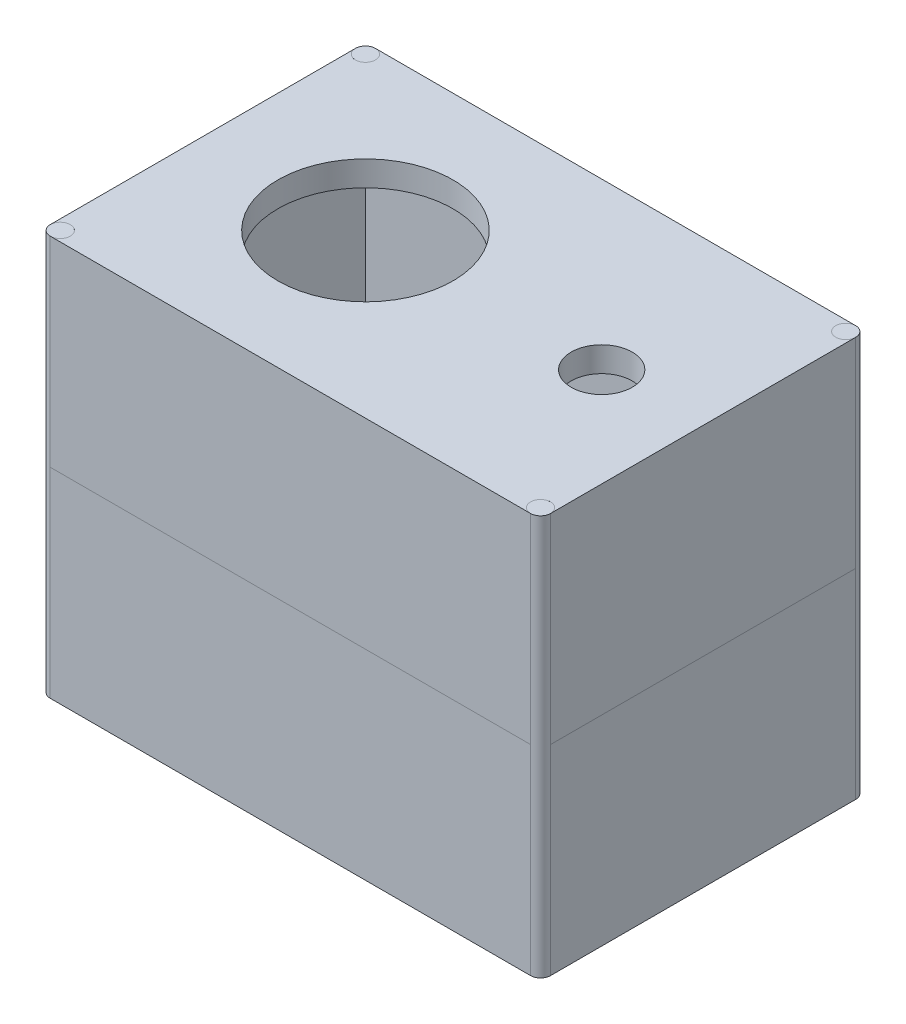
ISO-10303-21;
HEADER;
FILE_DESCRIPTION(('STEP AP214'),'2;1');
FILE_NAME('part.step','',(''),(''),'','','');
FILE_SCHEMA(('AUTOMOTIVE_DESIGN { 1 0 10303 214 1 1 1 1 }'));
ENDSEC;
DATA;
#1=APPLICATION_CONTEXT('core data for automotive mechanical design processes');
#2=APPLICATION_PROTOCOL_DEFINITION('international standard','automotive_design',2000,#1);
#3=PRODUCT_CONTEXT('',#1,'mechanical');
#4=PRODUCT('Part','Part','',(#3));
#5=PRODUCT_RELATED_PRODUCT_CATEGORY('part','',(#4));
#6=PRODUCT_DEFINITION_FORMATION('','',#4);
#7=PRODUCT_DEFINITION_CONTEXT('part definition',#1,'design');
#8=PRODUCT_DEFINITION('design','',#6,#7);
#9=PRODUCT_DEFINITION_SHAPE('','',#8);
#10=(LENGTH_UNIT() NAMED_UNIT(*) SI_UNIT(.MILLI.,.METRE.));
#11=(NAMED_UNIT(*) PLANE_ANGLE_UNIT() SI_UNIT($,.RADIAN.));
#12=(NAMED_UNIT(*) SI_UNIT($,.STERADIAN.) SOLID_ANGLE_UNIT());
#13=UNCERTAINTY_MEASURE_WITH_UNIT(LENGTH_MEASURE(1.E-05),#10,'distance_accuracy_value','');
#14=(GEOMETRIC_REPRESENTATION_CONTEXT(3) GLOBAL_UNCERTAINTY_ASSIGNED_CONTEXT((#13)) GLOBAL_UNIT_ASSIGNED_CONTEXT((#10,
#11,#12)) REPRESENTATION_CONTEXT('',''));
#15=CARTESIAN_POINT('',(0.,0.,0.));
#16=DIRECTION('',(0.,0.,1.));
#17=DIRECTION('',(1.,0.,0.));
#18=AXIS2_PLACEMENT_3D('',#15,#16,#17);
#19=CARTESIAN_POINT('',(0.,40.,0.));
#20=DIRECTION('',(0.,1.,0.));
#21=DIRECTION('',(0.,0.,1.));
#22=AXIS2_PLACEMENT_3D('',#19,#20,#21);
#23=PLANE('',#22);
#24=DIRECTION('',(0.,0.,1.));
#25=VECTOR('',#24,1.);
#26=CARTESIAN_POINT('',(50.9322033898305,40.,-28.0007704160247));
#27=LINE('',#26,#25);
#28=CARTESIAN_POINT('',(50.9322033898305,40.,-28.0007704160247));
#29=VERTEX_POINT('',#28);
#30=CARTESIAN_POINT('',(50.9322033898305,40.,26.9992295839753));
#31=VERTEX_POINT('',#30);
#32=EDGE_CURVE('E196',#29,#31,#27,.T.);
#33=ORIENTED_EDGE('',*,*,#32,.T.);
#34=DIRECTION('',(-1.,0.,0.));
#35=VECTOR('',#34,1.);
#36=CARTESIAN_POINT('',(-39.0677966101695,40.,26.9992295839753));
#37=LINE('',#36,#35);
#38=CARTESIAN_POINT('',(-39.0677966101695,40.,26.9992295839753));
#39=VERTEX_POINT('',#38);
#40=EDGE_CURVE('E193',#31,#39,#37,.T.);
#41=ORIENTED_EDGE('',*,*,#40,.T.);
#42=DIRECTION('',(0.,0.,-1.));
#43=VECTOR('',#42,1.);
#44=CARTESIAN_POINT('',(-39.0677966101695,40.,-28.0007704160247));
#45=LINE('',#44,#43);
#46=CARTESIAN_POINT('',(-39.0677966101695,40.,-28.0007704160247));
#47=VERTEX_POINT('',#46);
#48=EDGE_CURVE('E202',#39,#47,#45,.T.);
#49=ORIENTED_EDGE('',*,*,#48,.T.);
#50=DIRECTION('',(1.,0.,0.));
#51=VECTOR('',#50,1.);
#52=CARTESIAN_POINT('',(-39.0677966101695,40.,-28.0007704160247));
#53=LINE('',#52,#51);
#54=EDGE_CURVE('E199',#47,#29,#53,.T.);
#55=ORIENTED_EDGE('',*,*,#54,.T.);
#56=EDGE_LOOP('',(#33,#41,#49,#55));
#57=FACE_BOUND('',#56,.T.);
#58=DIRECTION('',(1.,0.,0.));
#59=VECTOR('',#58,1.);
#60=CARTESIAN_POINT('',(-44.0677966101695,40.,31.9992295839753));
#61=LINE('',#60,#59);
#62=CARTESIAN_POINT('',(-42.0677966101695,40.,31.9992295839753));
#63=VERTEX_POINT('',#62);
#64=CARTESIAN_POINT('',(53.9322033898305,40.,31.9992295839753));
#65=VERTEX_POINT('',#64);
#66=EDGE_CURVE('E205',#63,#65,#61,.T.);
#67=ORIENTED_EDGE('',*,*,#66,.T.);
#68=CARTESIAN_POINT('',(53.9322033898305,40.,29.9992295839753));
#69=DIRECTION('',(0.,1.,0.));
#70=DIRECTION('',(0.,0.,1.));
#71=AXIS2_PLACEMENT_3D('',#68,#69,#70);
#72=CIRCLE('',#71,2.);
#73=CARTESIAN_POINT('',(55.9322033898305,40.,29.9992295839753));
#74=VERTEX_POINT('',#73);
#75=EDGE_CURVE('E187',#65,#74,#72,.F.);
#76=ORIENTED_EDGE('',*,*,#75,.T.);
#77=DIRECTION('',(0.,0.,1.));
#78=VECTOR('',#77,1.);
#79=CARTESIAN_POINT('',(55.9322033898305,40.,29.9992295839753));
#80=LINE('',#79,#78);
#81=CARTESIAN_POINT('',(55.9322033898305,40.,-31.0007704160247));
#82=VERTEX_POINT('',#81);
#83=EDGE_CURVE('E179',#82,#74,#80,.T.);
#84=ORIENTED_EDGE('',*,*,#83,.F.);
#85=CARTESIAN_POINT('',(53.9322033898305,40.,-31.0007704160247));
#86=DIRECTION('',(0.,1.,0.));
#87=DIRECTION('',(0.,0.,1.));
#88=AXIS2_PLACEMENT_3D('',#85,#86,#87);
#89=CIRCLE('',#88,2.);
#90=CARTESIAN_POINT('',(53.9322033898305,40.,-33.0007704160247));
#91=VERTEX_POINT('',#90);
#92=EDGE_CURVE('E190',#82,#91,#89,.F.);
#93=ORIENTED_EDGE('',*,*,#92,.T.);
#94=DIRECTION('',(-1.,0.,0.));
#95=VECTOR('',#94,1.);
#96=CARTESIAN_POINT('',(-44.0677966101695,40.,-33.0007704160247));
#97=LINE('',#96,#95);
#98=CARTESIAN_POINT('',(-42.0677966101695,40.,-33.0007704160247));
#99=VERTEX_POINT('',#98);
#100=EDGE_CURVE('E208',#91,#99,#97,.T.);
#101=ORIENTED_EDGE('',*,*,#100,.T.);
#102=CARTESIAN_POINT('',(-42.0677966101695,40.,-31.0007704160247));
#103=DIRECTION('',(0.,1.,0.));
#104=DIRECTION('',(0.,0.,1.));
#105=AXIS2_PLACEMENT_3D('',#102,#103,#104);
#106=CIRCLE('',#105,2.);
#107=CARTESIAN_POINT('',(-44.0677966101695,40.,-31.0007704160247));
#108=VERTEX_POINT('',#107);
#109=EDGE_CURVE('E138',#99,#108,#106,.F.);
#110=ORIENTED_EDGE('',*,*,#109,.T.);
#111=DIRECTION('',(0.,0.,1.));
#112=VECTOR('',#111,1.);
#113=CARTESIAN_POINT('',(-44.0677966101695,40.,-33.0007704160247));
#114=LINE('',#113,#112);
#115=CARTESIAN_POINT('',(-44.0677966101695,40.,29.9992295839753));
#116=VERTEX_POINT('',#115);
#117=EDGE_CURVE('E210',#108,#116,#114,.T.);
#118=ORIENTED_EDGE('',*,*,#117,.T.);
#119=CARTESIAN_POINT('',(-42.0677966101695,40.,29.9992295839753));
#120=DIRECTION('',(0.,1.,0.));
#121=DIRECTION('',(0.,0.,1.));
#122=AXIS2_PLACEMENT_3D('',#119,#120,#121);
#123=CIRCLE('',#122,2.);
#124=EDGE_CURVE('E184',#116,#63,#123,.F.);
#125=ORIENTED_EDGE('',*,*,#124,.T.);
#126=EDGE_LOOP('',(#67,#76,#84,#93,#101,#110,#118,#125));
#127=FACE_BOUND('',#126,.T.);
#128=ADVANCED_FACE('F48',(#57,#127),#23,.T.);
#129=CARTESIAN_POINT('',(-44.0677966101695,80.,31.9992295839753));
#130=DIRECTION('',(0.,0.,-1.));
#131=DIRECTION('',(-1.,0.,0.));
#132=AXIS2_PLACEMENT_3D('',#129,#130,#131);
#133=PLANE('',#132);
#134=ORIENTED_EDGE('',*,*,#66,.F.);
#135=DIRECTION('',(0.,1.,0.));
#136=VECTOR('',#135,1.);
#137=CARTESIAN_POINT('',(-42.0677966101695,-0.00999999999999612,31.9992295839753));
#138=LINE('',#137,#136);
#139=CARTESIAN_POINT('',(-42.0677966101695,0.,31.9992295839753));
#140=VERTEX_POINT('',#139);
#141=EDGE_CURVE('E229',#140,#63,#138,.T.);
#142=ORIENTED_EDGE('',*,*,#141,.F.);
#143=DIRECTION('',(1.,0.,0.));
#144=VECTOR('',#143,1.);
#145=CARTESIAN_POINT('',(-44.0677966101695,0.,31.9992295839753));
#146=LINE('',#145,#144);
#147=CARTESIAN_POINT('',(53.9322033898305,0.,31.9992295839753));
#148=VERTEX_POINT('',#147);
#149=EDGE_CURVE('E162',#140,#148,#146,.T.);
#150=ORIENTED_EDGE('',*,*,#149,.T.);
#151=DIRECTION('',(0.,1.,0.));
#152=VECTOR('',#151,1.);
#153=CARTESIAN_POINT('',(53.9322033898305,-0.00999999999999612,31.9992295839753));
#154=LINE('',#153,#152);
#155=EDGE_CURVE('E221',#148,#65,#154,.T.);
#156=ORIENTED_EDGE('',*,*,#155,.T.);
#157=EDGE_LOOP('',(#134,#142,#150,#156));
#158=FACE_BOUND('',#157,.T.);
#159=ADVANCED_FACE('F243',(#158),#133,.F.);
#160=CARTESIAN_POINT('',(-44.0677966101695,80.,-33.0007704160247));
#161=DIRECTION('',(0.,0.,1.));
#162=DIRECTION('',(1.,0.,0.));
#163=AXIS2_PLACEMENT_3D('',#160,#161,#162);
#164=PLANE('',#163);
#165=ORIENTED_EDGE('',*,*,#100,.F.);
#166=DIRECTION('',(0.,1.,0.));
#167=VECTOR('',#166,1.);
#168=CARTESIAN_POINT('',(53.9322033898305,-0.00999999999999612,-33.0007704160247));
#169=LINE('',#168,#167);
#170=CARTESIAN_POINT('',(53.9322033898305,0.,-33.0007704160247));
#171=VERTEX_POINT('',#170);
#172=EDGE_CURVE('E12',#171,#91,#169,.T.);
#173=ORIENTED_EDGE('',*,*,#172,.F.);
#174=DIRECTION('',(-1.,0.,0.));
#175=VECTOR('',#174,1.);
#176=CARTESIAN_POINT('',(-44.0677966101695,0.,-33.0007704160247));
#177=LINE('',#176,#175);
#178=CARTESIAN_POINT('',(-42.0677966101695,0.,-33.0007704160247));
#179=VERTEX_POINT('',#178);
#180=EDGE_CURVE('E144',#171,#179,#177,.T.);
#181=ORIENTED_EDGE('',*,*,#180,.T.);
#182=DIRECTION('',(0.,1.,0.));
#183=VECTOR('',#182,1.);
#184=CARTESIAN_POINT('',(-42.0677966101695,-0.00999999999999612,-33.0007704160247));
#185=LINE('',#184,#183);
#186=EDGE_CURVE('E132',#179,#99,#185,.T.);
#187=ORIENTED_EDGE('',*,*,#186,.T.);
#188=EDGE_LOOP('',(#165,#173,#181,#187));
#189=FACE_BOUND('',#188,.T.);
#190=ADVANCED_FACE('F158',(#189),#164,.F.);
#191=CARTESIAN_POINT('',(-44.0677966101695,80.,-33.0007704160247));
#192=DIRECTION('',(1.,0.,0.));
#193=DIRECTION('',(0.,0.,-1.));
#194=AXIS2_PLACEMENT_3D('',#191,#192,#193);
#195=PLANE('',#194);
#196=ORIENTED_EDGE('',*,*,#117,.F.);
#197=DIRECTION('',(0.,1.,0.));
#198=VECTOR('',#197,1.);
#199=CARTESIAN_POINT('',(-44.0677966101695,-0.00999999999999612,-31.0007704160247));
#200=LINE('',#199,#198);
#201=CARTESIAN_POINT('',(-44.0677966101695,0.,-31.0007704160247));
#202=VERTEX_POINT('',#201);
#203=EDGE_CURVE('E227',#202,#108,#200,.T.);
#204=ORIENTED_EDGE('',*,*,#203,.F.);
#205=DIRECTION('',(0.,0.,1.));
#206=VECTOR('',#205,1.);
#207=CARTESIAN_POINT('',(-44.0677966101695,0.,-33.0007704160247));
#208=LINE('',#207,#206);
#209=CARTESIAN_POINT('',(-44.0677966101695,0.,29.9992295839753));
#210=VERTEX_POINT('',#209);
#211=EDGE_CURVE('E153',#202,#210,#208,.T.);
#212=ORIENTED_EDGE('',*,*,#211,.T.);
#213=DIRECTION('',(0.,1.,0.));
#214=VECTOR('',#213,1.);
#215=CARTESIAN_POINT('',(-44.0677966101695,-0.00999999999999612,29.9992295839753));
#216=LINE('',#215,#214);
#217=EDGE_CURVE('E224',#210,#116,#216,.T.);
#218=ORIENTED_EDGE('',*,*,#217,.T.);
#219=EDGE_LOOP('',(#196,#204,#212,#218));
#220=FACE_BOUND('',#219,.T.);
#221=ADVANCED_FACE('F50',(#220),#195,.F.);
#222=CARTESIAN_POINT('',(0.,0.,0.));
#223=DIRECTION('',(0.,1.,0.));
#224=DIRECTION('',(0.,0.,1.));
#225=AXIS2_PLACEMENT_3D('',#222,#223,#224);
#226=PLANE('',#225);
#227=ORIENTED_EDGE('',*,*,#211,.F.);
#228=CARTESIAN_POINT('',(-42.0677966101695,0.,-31.0007704160247));
#229=DIRECTION('',(0.,1.,0.));
#230=DIRECTION('',(0.,0.,1.));
#231=AXIS2_PLACEMENT_3D('',#228,#229,#230);
#232=CIRCLE('',#231,2.);
#233=EDGE_CURVE('E135',#179,#202,#232,.T.);
#234=ORIENTED_EDGE('',*,*,#233,.F.);
#235=ORIENTED_EDGE('',*,*,#180,.F.);
#236=CARTESIAN_POINT('',(53.9322033898305,0.,-31.0007704160247));
#237=DIRECTION('',(0.,1.,0.));
#238=DIRECTION('',(0.,0.,1.));
#239=AXIS2_PLACEMENT_3D('',#236,#237,#238);
#240=CIRCLE('',#239,2.);
#241=CARTESIAN_POINT('',(55.9322033898305,0.,-31.0007704160247));
#242=VERTEX_POINT('',#241);
#243=EDGE_CURVE('E166',#242,#171,#240,.T.);
#244=ORIENTED_EDGE('',*,*,#243,.F.);
#245=DIRECTION('',(0.,0.,-1.));
#246=VECTOR('',#245,1.);
#247=CARTESIAN_POINT('',(55.9322033898305,0.,-33.0007704160247));
#248=LINE('',#247,#246);
#249=CARTESIAN_POINT('',(55.9322033898305,0.,29.9992295839753));
#250=VERTEX_POINT('',#249);
#251=EDGE_CURVE('E159',#250,#242,#248,.T.);
#252=ORIENTED_EDGE('',*,*,#251,.F.);
#253=CARTESIAN_POINT('',(53.9322033898305,0.,29.9992295839753));
#254=DIRECTION('',(0.,1.,0.));
#255=DIRECTION('',(0.,0.,1.));
#256=AXIS2_PLACEMENT_3D('',#253,#254,#255);
#257=CIRCLE('',#256,2.);
#258=EDGE_CURVE('E234',#148,#250,#257,.T.);
#259=ORIENTED_EDGE('',*,*,#258,.F.);
#260=ORIENTED_EDGE('',*,*,#149,.F.);
#261=CARTESIAN_POINT('',(-42.0677966101695,0.,29.9992295839753));
#262=DIRECTION('',(0.,1.,0.));
#263=DIRECTION('',(0.,0.,1.));
#264=AXIS2_PLACEMENT_3D('',#261,#262,#263);
#265=CIRCLE('',#264,2.);
#266=EDGE_CURVE('E154',#210,#140,#265,.T.);
#267=ORIENTED_EDGE('',*,*,#266,.F.);
#268=EDGE_LOOP('',(#227,#234,#235,#244,#252,#259,#260,#267));
#269=FACE_BOUND('',#268,.T.);
#270=ADVANCED_FACE('F149',(#269),#226,.F.);
#271=CARTESIAN_POINT('',(55.9322033898305,80.,-33.0007704160247));
#272=DIRECTION('',(-1.,0.,0.));
#273=DIRECTION('',(0.,0.,1.));
#274=AXIS2_PLACEMENT_3D('',#271,#272,#273);
#275=PLANE('',#274);
#276=DIRECTION('',(0.,1.,0.));
#277=VECTOR('',#276,1.);
#278=CARTESIAN_POINT('',(55.9322033898305,-0.00999999999999612,-31.0007704160247));
#279=LINE('',#278,#277);
#280=EDGE_CURVE('E143',#242,#82,#279,.T.);
#281=ORIENTED_EDGE('',*,*,#280,.T.);
#282=ORIENTED_EDGE('',*,*,#83,.T.);
#283=DIRECTION('',(0.,1.,0.));
#284=VECTOR('',#283,1.);
#285=CARTESIAN_POINT('',(55.9322033898305,-0.00999999999999612,29.9992295839753));
#286=LINE('',#285,#284);
#287=EDGE_CURVE('E57',#250,#74,#286,.T.);
#288=ORIENTED_EDGE('',*,*,#287,.F.);
#289=ORIENTED_EDGE('',*,*,#251,.T.);
#290=EDGE_LOOP('',(#281,#282,#288,#289));
#291=FACE_BOUND('',#290,.T.);
#292=ADVANCED_FACE('F238',(#291),#275,.F.);
#293=CARTESIAN_POINT('',(-39.0677966101695,-175.475115548645,26.9992295839753));
#294=DIRECTION('',(0.,0.,1.));
#295=DIRECTION('',(1.,0.,0.));
#296=AXIS2_PLACEMENT_3D('',#293,#294,#295);
#297=PLANE('',#296);
#298=ORIENTED_EDGE('',*,*,#40,.F.);
#299=DIRECTION('',(0.,1.,0.));
#300=VECTOR('',#299,1.);
#301=CARTESIAN_POINT('',(50.9322033898305,-175.475115548645,26.9992295839753));
#302=LINE('',#301,#300);
#303=CARTESIAN_POINT('',(50.9322033898305,5.,26.9992295839753));
#304=VERTEX_POINT('',#303);
#305=EDGE_CURVE('E214',#304,#31,#302,.T.);
#306=ORIENTED_EDGE('',*,*,#305,.F.);
#307=DIRECTION('',(-1.,0.,0.));
#308=VECTOR('',#307,1.);
#309=CARTESIAN_POINT('',(-39.0677966101695,5.,26.9992295839753));
#310=LINE('',#309,#308);
#311=CARTESIAN_POINT('',(-39.0677966101695,5.,26.9992295839753));
#312=VERTEX_POINT('',#311);
#313=EDGE_CURVE('E169',#304,#312,#310,.T.);
#314=ORIENTED_EDGE('',*,*,#313,.T.);
#315=DIRECTION('',(0.,1.,0.));
#316=VECTOR('',#315,1.);
#317=CARTESIAN_POINT('',(-39.0677966101695,-175.475115548645,26.9992295839753));
#318=LINE('',#317,#316);
#319=EDGE_CURVE('E182',#312,#39,#318,.T.);
#320=ORIENTED_EDGE('',*,*,#319,.T.);
#321=EDGE_LOOP('',(#298,#306,#314,#320));
#322=FACE_BOUND('',#321,.T.);
#323=ADVANCED_FACE('F272',(#322),#297,.F.);
#324=CARTESIAN_POINT('',(50.9322033898305,-175.475115548645,-28.0007704160247));
#325=DIRECTION('',(1.,0.,0.));
#326=DIRECTION('',(0.,0.,-1.));
#327=AXIS2_PLACEMENT_3D('',#324,#325,#326);
#328=PLANE('',#327);
#329=ORIENTED_EDGE('',*,*,#32,.F.);
#330=DIRECTION('',(0.,1.,0.));
#331=VECTOR('',#330,1.);
#332=CARTESIAN_POINT('',(50.9322033898305,-175.475115548645,-28.0007704160247));
#333=LINE('',#332,#331);
#334=CARTESIAN_POINT('',(50.9322033898305,5.,-28.0007704160247));
#335=VERTEX_POINT('',#334);
#336=EDGE_CURVE('E216',#335,#29,#333,.T.);
#337=ORIENTED_EDGE('',*,*,#336,.F.);
#338=DIRECTION('',(0.,0.,1.));
#339=VECTOR('',#338,1.);
#340=CARTESIAN_POINT('',(50.9322033898305,5.,-28.0007704160247));
#341=LINE('',#340,#339);
#342=EDGE_CURVE('E172',#335,#304,#341,.T.);
#343=ORIENTED_EDGE('',*,*,#342,.T.);
#344=ORIENTED_EDGE('',*,*,#305,.T.);
#345=EDGE_LOOP('',(#329,#337,#343,#344));
#346=FACE_BOUND('',#345,.T.);
#347=ADVANCED_FACE('F278',(#346),#328,.F.);
#348=CARTESIAN_POINT('',(-39.0677966101695,-175.475115548645,-28.0007704160247));
#349=DIRECTION('',(0.,0.,-1.));
#350=DIRECTION('',(-1.,0.,0.));
#351=AXIS2_PLACEMENT_3D('',#348,#349,#350);
#352=PLANE('',#351);
#353=ORIENTED_EDGE('',*,*,#54,.F.);
#354=DIRECTION('',(0.,1.,0.));
#355=VECTOR('',#354,1.);
#356=CARTESIAN_POINT('',(-39.0677966101695,-175.475115548645,-28.0007704160247));
#357=LINE('',#356,#355);
#358=CARTESIAN_POINT('',(-39.0677966101695,5.,-28.0007704160247));
#359=VERTEX_POINT('',#358);
#360=EDGE_CURVE('E174',#359,#47,#357,.T.);
#361=ORIENTED_EDGE('',*,*,#360,.F.);
#362=DIRECTION('',(1.,0.,0.));
#363=VECTOR('',#362,1.);
#364=CARTESIAN_POINT('',(-39.0677966101695,5.,-28.0007704160247));
#365=LINE('',#364,#363);
#366=EDGE_CURVE('E63',#359,#335,#365,.T.);
#367=ORIENTED_EDGE('',*,*,#366,.T.);
#368=ORIENTED_EDGE('',*,*,#336,.T.);
#369=EDGE_LOOP('',(#353,#361,#367,#368));
#370=FACE_BOUND('',#369,.T.);
#371=ADVANCED_FACE('F295',(#370),#352,.F.);
#372=CARTESIAN_POINT('',(-39.0677966101695,-175.475115548645,-28.0007704160247));
#373=DIRECTION('',(-1.,0.,0.));
#374=DIRECTION('',(0.,0.,1.));
#375=AXIS2_PLACEMENT_3D('',#372,#373,#374);
#376=PLANE('',#375);
#377=ORIENTED_EDGE('',*,*,#48,.F.);
#378=ORIENTED_EDGE('',*,*,#319,.F.);
#379=DIRECTION('',(0.,0.,-1.));
#380=VECTOR('',#379,1.);
#381=CARTESIAN_POINT('',(-39.0677966101695,5.,-28.0007704160247));
#382=LINE('',#381,#380);
#383=EDGE_CURVE('E176',#312,#359,#382,.T.);
#384=ORIENTED_EDGE('',*,*,#383,.T.);
#385=ORIENTED_EDGE('',*,*,#360,.T.);
#386=EDGE_LOOP('',(#377,#378,#384,#385));
#387=FACE_BOUND('',#386,.T.);
#388=ADVANCED_FACE('F293',(#387),#376,.F.);
#389=CARTESIAN_POINT('',(0.,5.,0.));
#390=DIRECTION('',(0.,1.,0.));
#391=DIRECTION('',(0.,0.,1.));
#392=AXIS2_PLACEMENT_3D('',#389,#390,#391);
#393=PLANE('',#392);
#394=ORIENTED_EDGE('',*,*,#383,.F.);
#395=ORIENTED_EDGE('',*,*,#313,.F.);
#396=ORIENTED_EDGE('',*,*,#342,.F.);
#397=ORIENTED_EDGE('',*,*,#366,.F.);
#398=EDGE_LOOP('',(#394,#395,#396,#397));
#399=FACE_BOUND('',#398,.T.);
#400=ADVANCED_FACE('F291',(#399),#393,.T.);
#401=CARTESIAN_POINT('',(53.9322033898305,-0.00999999999999612,-31.0007704160247));
#402=DIRECTION('',(0.,1.,0.));
#403=DIRECTION('',(0.,0.,1.));
#404=AXIS2_PLACEMENT_3D('',#401,#402,#403);
#405=CYLINDRICAL_SURFACE('',#404,2.);
#406=CARTESIAN_POINT('',(53.9322033898305,80.,-31.0007704160247));
#407=DIRECTION('',(0.,1.,0.));
#408=DIRECTION('',(0.,0.,1.));
#409=AXIS2_PLACEMENT_3D('',#406,#407,#408);
#410=CIRCLE('',#409,2.);
#411=CARTESIAN_POINT('',(53.9322033898305,80.,-29.0007704160246));
#412=VERTEX_POINT('',#411);
#413=EDGE_CURVE('E245',#412,#412,#410,.T.);
#414=ORIENTED_EDGE('',*,*,#413,.F.);
#415=EDGE_LOOP('',(#414));
#416=FACE_BOUND('',#415,.T.);
#417=ORIENTED_EDGE('',*,*,#280,.F.);
#418=ORIENTED_EDGE('',*,*,#243,.T.);
#419=ORIENTED_EDGE('',*,*,#172,.T.);
#420=ORIENTED_EDGE('',*,*,#92,.F.);
#421=EDGE_LOOP('',(#417,#418,#419,#420));
#422=FACE_BOUND('',#421,.T.);
#423=ADVANCED_FACE('F290',(#416,#422),#405,.T.);
#424=CARTESIAN_POINT('',(0.,80.,0.));
#425=DIRECTION('',(0.,1.,0.));
#426=DIRECTION('',(0.,0.,1.));
#427=AXIS2_PLACEMENT_3D('',#424,#425,#426);
#428=PLANE('',#427);
#429=ORIENTED_EDGE('',*,*,#413,.T.);
#430=EDGE_LOOP('',(#429));
#431=FACE_BOUND('',#430,.T.);
#432=ADVANCED_FACE('F321',(#431),#428,.T.);
#433=CARTESIAN_POINT('',(53.9322033898305,-0.00999999999999612,29.9992295839753));
#434=DIRECTION('',(0.,1.,0.));
#435=DIRECTION('',(0.,0.,1.));
#436=AXIS2_PLACEMENT_3D('',#433,#434,#435);
#437=CYLINDRICAL_SURFACE('',#436,2.);
#438=CARTESIAN_POINT('',(53.9322033898305,80.,29.9992295839753));
#439=DIRECTION('',(0.,1.,0.));
#440=DIRECTION('',(0.,0.,1.));
#441=AXIS2_PLACEMENT_3D('',#438,#439,#440);
#442=CIRCLE('',#441,2.);
#443=CARTESIAN_POINT('',(53.9322033898305,80.,31.9992295839753));
#444=VERTEX_POINT('',#443);
#445=EDGE_CURVE('E246',#444,#444,#442,.T.);
#446=ORIENTED_EDGE('',*,*,#445,.F.);
#447=EDGE_LOOP('',(#446));
#448=FACE_BOUND('',#447,.T.);
#449=ORIENTED_EDGE('',*,*,#155,.F.);
#450=ORIENTED_EDGE('',*,*,#258,.T.);
#451=ORIENTED_EDGE('',*,*,#287,.T.);
#452=ORIENTED_EDGE('',*,*,#75,.F.);
#453=EDGE_LOOP('',(#449,#450,#451,#452));
#454=FACE_BOUND('',#453,.T.);
#455=ADVANCED_FACE('F232',(#448,#454),#437,.T.);
#456=CARTESIAN_POINT('',(0.,80.,0.));
#457=DIRECTION('',(0.,1.,0.));
#458=DIRECTION('',(0.,0.,1.));
#459=AXIS2_PLACEMENT_3D('',#456,#457,#458);
#460=PLANE('',#459);
#461=ORIENTED_EDGE('',*,*,#445,.T.);
#462=EDGE_LOOP('',(#461));
#463=FACE_BOUND('',#462,.T.);
#464=ADVANCED_FACE('F330',(#463),#460,.T.);
#465=CARTESIAN_POINT('',(-42.0677966101695,-0.00999999999999612,29.9992295839753));
#466=DIRECTION('',(0.,1.,0.));
#467=DIRECTION('',(0.,0.,1.));
#468=AXIS2_PLACEMENT_3D('',#465,#466,#467);
#469=CYLINDRICAL_SURFACE('',#468,2.);
#470=CARTESIAN_POINT('',(-42.0677966101695,80.,29.9992295839753));
#471=DIRECTION('',(0.,1.,0.));
#472=DIRECTION('',(0.,0.,1.));
#473=AXIS2_PLACEMENT_3D('',#470,#471,#472);
#474=CIRCLE('',#473,2.);
#475=CARTESIAN_POINT('',(-42.0677966101695,80.,31.9992295839753));
#476=VERTEX_POINT('',#475);
#477=EDGE_CURVE('E250',#476,#476,#474,.T.);
#478=ORIENTED_EDGE('',*,*,#477,.F.);
#479=EDGE_LOOP('',(#478));
#480=FACE_BOUND('',#479,.T.);
#481=ORIENTED_EDGE('',*,*,#217,.F.);
#482=ORIENTED_EDGE('',*,*,#266,.T.);
#483=ORIENTED_EDGE('',*,*,#141,.T.);
#484=ORIENTED_EDGE('',*,*,#124,.F.);
#485=EDGE_LOOP('',(#481,#482,#483,#484));
#486=FACE_BOUND('',#485,.T.);
#487=ADVANCED_FACE('F268',(#480,#486),#469,.T.);
#488=CARTESIAN_POINT('',(0.,80.,0.));
#489=DIRECTION('',(0.,1.,0.));
#490=DIRECTION('',(0.,0.,1.));
#491=AXIS2_PLACEMENT_3D('',#488,#489,#490);
#492=PLANE('',#491);
#493=ORIENTED_EDGE('',*,*,#477,.T.);
#494=EDGE_LOOP('',(#493));
#495=FACE_BOUND('',#494,.T.);
#496=ADVANCED_FACE('F262',(#495),#492,.T.);
#497=CARTESIAN_POINT('',(-42.0677966101695,-0.00999999999999612,-31.0007704160247));
#498=DIRECTION('',(0.,1.,0.));
#499=DIRECTION('',(0.,0.,1.));
#500=AXIS2_PLACEMENT_3D('',#497,#498,#499);
#501=CYLINDRICAL_SURFACE('',#500,2.);
#502=CARTESIAN_POINT('',(-42.0677966101695,80.,-31.0007704160247));
#503=DIRECTION('',(0.,1.,0.));
#504=DIRECTION('',(0.,0.,1.));
#505=AXIS2_PLACEMENT_3D('',#502,#503,#504);
#506=CIRCLE('',#505,2.);
#507=CARTESIAN_POINT('',(-42.0677966101695,80.,-29.0007704160246));
#508=VERTEX_POINT('',#507);
#509=EDGE_CURVE('E155',#508,#508,#506,.T.);
#510=ORIENTED_EDGE('',*,*,#509,.F.);
#511=EDGE_LOOP('',(#510));
#512=FACE_BOUND('',#511,.T.);
#513=ORIENTED_EDGE('',*,*,#186,.F.);
#514=ORIENTED_EDGE('',*,*,#233,.T.);
#515=ORIENTED_EDGE('',*,*,#203,.T.);
#516=ORIENTED_EDGE('',*,*,#109,.F.);
#517=EDGE_LOOP('',(#513,#514,#515,#516));
#518=FACE_BOUND('',#517,.T.);
#519=ADVANCED_FACE('F134',(#512,#518),#501,.T.);
#520=CARTESIAN_POINT('',(0.,80.,0.));
#521=DIRECTION('',(0.,1.,0.));
#522=DIRECTION('',(0.,0.,1.));
#523=AXIS2_PLACEMENT_3D('',#520,#521,#522);
#524=PLANE('',#523);
#525=ORIENTED_EDGE('',*,*,#509,.T.);
#526=EDGE_LOOP('',(#525));
#527=FACE_BOUND('',#526,.T.);
#528=ADVANCED_FACE('F259',(#527),#524,.T.);
#529=CLOSED_SHELL('',(#128,#159,#190,#221,#270,#292,#323,#347,#371,#388,#400,#423,#432,#455,
#464,#487,#496,#519,#528));
#530=MANIFOLD_SOLID_BREP('B2',#529);
#531=CARTESIAN_POINT('',(0.,40.,0.));
#532=DIRECTION('',(0.,1.,0.));
#533=DIRECTION('',(0.,0.,1.));
#534=AXIS2_PLACEMENT_3D('',#531,#532,#533);
#535=PLANE('',#534);
#536=DIRECTION('',(1.,0.,0.));
#537=VECTOR('',#536,1.);
#538=CARTESIAN_POINT('',(-44.0677966101695,40.,31.9992295839753));
#539=LINE('',#538,#537);
#540=CARTESIAN_POINT('',(-42.0677966101695,40.,31.9992295839753));
#541=VERTEX_POINT('',#540);
#542=CARTESIAN_POINT('',(53.9322033898305,40.,31.9992295839753));
#543=VERTEX_POINT('',#542);
#544=EDGE_CURVE('E627',#541,#543,#539,.T.);
#545=ORIENTED_EDGE('',*,*,#544,.F.);
#546=CARTESIAN_POINT('',(-42.0677966101695,40.,29.9992295839753));
#547=DIRECTION('',(0.,1.,0.));
#548=DIRECTION('',(0.,0.,1.));
#549=AXIS2_PLACEMENT_3D('',#546,#547,#548);
#550=CIRCLE('',#549,2.);
#551=CARTESIAN_POINT('',(-44.0677966101695,40.,29.9992295839753));
#552=VERTEX_POINT('',#551);
#553=EDGE_CURVE('E623',#552,#541,#550,.F.);
#554=ORIENTED_EDGE('',*,*,#553,.F.);
#555=DIRECTION('',(0.,0.,1.));
#556=VECTOR('',#555,1.);
#557=CARTESIAN_POINT('',(-44.0677966101695,40.,-33.0007704160247));
#558=LINE('',#557,#556);
#559=CARTESIAN_POINT('',(-44.0677966101695,40.,-31.0007704160247));
#560=VERTEX_POINT('',#559);
#561=EDGE_CURVE('E619',#560,#552,#558,.T.);
#562=ORIENTED_EDGE('',*,*,#561,.F.);
#563=CARTESIAN_POINT('',(-42.0677966101695,40.,-31.0007704160247));
#564=DIRECTION('',(0.,1.,0.));
#565=DIRECTION('',(0.,0.,1.));
#566=AXIS2_PLACEMENT_3D('',#563,#564,#565);
#567=CIRCLE('',#566,2.);
#568=CARTESIAN_POINT('',(-42.0677966101695,40.,-33.0007704160247));
#569=VERTEX_POINT('',#568);
#570=EDGE_CURVE('E496',#569,#560,#567,.F.);
#571=ORIENTED_EDGE('',*,*,#570,.F.);
#572=DIRECTION('',(-1.,0.,0.));
#573=VECTOR('',#572,1.);
#574=CARTESIAN_POINT('',(-44.0677966101695,40.,-33.0007704160247));
#575=LINE('',#574,#573);
#576=CARTESIAN_POINT('',(53.9322033898305,40.,-33.0007704160247));
#577=VERTEX_POINT('',#576);
#578=EDGE_CURVE('E620',#577,#569,#575,.T.);
#579=ORIENTED_EDGE('',*,*,#578,.F.);
#580=CARTESIAN_POINT('',(53.9322033898305,40.,-31.0007704160247));
#581=DIRECTION('',(0.,1.,0.));
#582=DIRECTION('',(0.,0.,1.));
#583=AXIS2_PLACEMENT_3D('',#580,#581,#582);
#584=CIRCLE('',#583,2.);
#585=CARTESIAN_POINT('',(55.9322033898305,40.,-31.0007704160247));
#586=VERTEX_POINT('',#585);
#587=EDGE_CURVE('E631',#586,#577,#584,.F.);
#588=ORIENTED_EDGE('',*,*,#587,.F.);
#589=DIRECTION('',(0.,0.,1.));
#590=VECTOR('',#589,1.);
#591=CARTESIAN_POINT('',(55.9322033898305,40.,29.9992295839753));
#592=LINE('',#591,#590);
#593=CARTESIAN_POINT('',(55.9322033898305,40.,29.9992295839753));
#594=VERTEX_POINT('',#593);
#595=EDGE_CURVE('E46',#586,#594,#592,.T.);
#596=ORIENTED_EDGE('',*,*,#595,.T.);
#597=CARTESIAN_POINT('',(53.9322033898305,40.,29.9992295839753));
#598=DIRECTION('',(0.,1.,0.));
#599=DIRECTION('',(0.,0.,1.));
#600=AXIS2_PLACEMENT_3D('',#597,#598,#599);
#601=CIRCLE('',#600,2.);
#602=EDGE_CURVE('E504',#543,#594,#601,.F.);
#603=ORIENTED_EDGE('',*,*,#602,.F.);
#604=EDGE_LOOP('',(#545,#554,#562,#571,#579,#588,#596,#603));
#605=FACE_BOUND('',#604,.T.);
#606=DIRECTION('',(0.,0.,1.));
#607=VECTOR('',#606,1.);
#608=CARTESIAN_POINT('',(50.9322033898305,40.,-28.0007704160247));
#609=LINE('',#608,#607);
#610=CARTESIAN_POINT('',(50.9322033898305,40.,-28.0007704160247));
#611=VERTEX_POINT('',#610);
#612=CARTESIAN_POINT('',(50.9322033898305,40.,26.9992295839753));
#613=VERTEX_POINT('',#612);
#614=EDGE_CURVE('E636',#611,#613,#609,.T.);
#615=ORIENTED_EDGE('',*,*,#614,.F.);
#616=DIRECTION('',(1.,0.,0.));
#617=VECTOR('',#616,1.);
#618=CARTESIAN_POINT('',(-39.0677966101695,40.,-28.0007704160247));
#619=LINE('',#618,#617);
#620=CARTESIAN_POINT('',(-39.0677966101695,40.,-28.0007704160247));
#621=VERTEX_POINT('',#620);
#622=EDGE_CURVE('E635',#621,#611,#619,.T.);
#623=ORIENTED_EDGE('',*,*,#622,.F.);
#624=DIRECTION('',(0.,0.,-1.));
#625=VECTOR('',#624,1.);
#626=CARTESIAN_POINT('',(-39.0677966101695,40.,-28.0007704160247));
#627=LINE('',#626,#625);
#628=CARTESIAN_POINT('',(-39.0677966101695,40.,26.9992295839753));
#629=VERTEX_POINT('',#628);
#630=EDGE_CURVE('E630',#629,#621,#627,.T.);
#631=ORIENTED_EDGE('',*,*,#630,.F.);
#632=DIRECTION('',(-1.,0.,0.));
#633=VECTOR('',#632,1.);
#634=CARTESIAN_POINT('',(-39.0677966101695,40.,26.9992295839753));
#635=LINE('',#634,#633);
#636=EDGE_CURVE('E491',#613,#629,#635,.T.);
#637=ORIENTED_EDGE('',*,*,#636,.F.);
#638=EDGE_LOOP('',(#615,#623,#631,#637));
#639=FACE_BOUND('',#638,.T.);
#640=ADVANCED_FACE('F488',(#605,#639),#535,.F.);
#641=CARTESIAN_POINT('',(55.9322033898305,80.,-33.0007704160247));
#642=DIRECTION('',(-1.,0.,0.));
#643=DIRECTION('',(0.,0.,1.));
#644=AXIS2_PLACEMENT_3D('',#641,#642,#643);
#645=PLANE('',#644);
#646=ORIENTED_EDGE('',*,*,#595,.F.);
#647=DIRECTION('',(0.,1.,0.));
#648=VECTOR('',#647,1.);
#649=CARTESIAN_POINT('',(55.9322033898305,-0.00999999999999612,-31.0007704160247));
#650=LINE('',#649,#648);
#651=CARTESIAN_POINT('',(55.9322033898305,80.,-31.0007704160247));
#652=VERTEX_POINT('',#651);
#653=EDGE_CURVE('E617',#586,#652,#650,.T.);
#654=ORIENTED_EDGE('',*,*,#653,.T.);
#655=DIRECTION('',(0.,0.,-1.));
#656=VECTOR('',#655,1.);
#657=CARTESIAN_POINT('',(55.9322033898305,80.,-33.0007704160247));
#658=LINE('',#657,#656);
#659=CARTESIAN_POINT('',(55.9322033898305,80.,29.9992295839753));
#660=VERTEX_POINT('',#659);
#661=EDGE_CURVE('E610',#660,#652,#658,.T.);
#662=ORIENTED_EDGE('',*,*,#661,.F.);
#663=DIRECTION('',(0.,1.,0.));
#664=VECTOR('',#663,1.);
#665=CARTESIAN_POINT('',(55.9322033898305,-0.00999999999999612,29.9992295839753));
#666=LINE('',#665,#664);
#667=EDGE_CURVE('E683',#594,#660,#666,.T.);
#668=ORIENTED_EDGE('',*,*,#667,.F.);
#669=EDGE_LOOP('',(#646,#654,#662,#668));
#670=FACE_BOUND('',#669,.T.);
#671=ADVANCED_FACE('F707',(#670),#645,.F.);
#672=CARTESIAN_POINT('',(50.9322033898305,-175.475115548645,-28.0007704160247));
#673=DIRECTION('',(1.,0.,0.));
#674=DIRECTION('',(0.,0.,-1.));
#675=AXIS2_PLACEMENT_3D('',#672,#673,#674);
#676=PLANE('',#675);
#677=DIRECTION('',(0.,1.,0.));
#678=VECTOR('',#677,1.);
#679=CARTESIAN_POINT('',(50.9322033898305,-175.475115548645,-28.0007704160247));
#680=LINE('',#679,#678);
#681=CARTESIAN_POINT('',(50.9322033898305,75.,-28.0007704160247));
#682=VERTEX_POINT('',#681);
#683=EDGE_CURVE('E607',#611,#682,#680,.T.);
#684=ORIENTED_EDGE('',*,*,#683,.F.);
#685=ORIENTED_EDGE('',*,*,#614,.T.);
#686=DIRECTION('',(0.,1.,0.));
#687=VECTOR('',#686,1.);
#688=CARTESIAN_POINT('',(50.9322033898305,-175.475115548645,26.9992295839753));
#689=LINE('',#688,#687);
#690=CARTESIAN_POINT('',(50.9322033898305,75.,26.9992295839753));
#691=VERTEX_POINT('',#690);
#692=EDGE_CURVE('E649',#613,#691,#689,.T.);
#693=ORIENTED_EDGE('',*,*,#692,.T.);
#694=DIRECTION('',(0.,0.,-1.));
#695=VECTOR('',#694,1.);
#696=CARTESIAN_POINT('',(50.9322033898305,75.,-28.0007704160247));
#697=LINE('',#696,#695);
#698=EDGE_CURVE('E661',#691,#682,#697,.T.);
#699=ORIENTED_EDGE('',*,*,#698,.T.);
#700=EDGE_LOOP('',(#684,#685,#693,#699));
#701=FACE_BOUND('',#700,.T.);
#702=ADVANCED_FACE('F720',(#701),#676,.F.);
#703=CARTESIAN_POINT('',(0.,75.,0.));
#704=DIRECTION('',(0.,1.,0.));
#705=DIRECTION('',(0.,0.,1.));
#706=AXIS2_PLACEMENT_3D('',#703,#704,#705);
#707=PLANE('',#706);
#708=CARTESIAN_POINT('',(36.1553778472485,75.,0.));
#709=DIRECTION('',(0.,1.,0.));
#710=DIRECTION('',(0.,0.,1.));
#711=AXIS2_PLACEMENT_3D('',#708,#709,#710);
#712=CIRCLE('',#711,6.10322585973708);
#713=CARTESIAN_POINT('',(36.1553778472485,75.,6.10322585973708));
#714=VERTEX_POINT('',#713);
#715=EDGE_CURVE('E675',#714,#714,#712,.T.);
#716=ORIENTED_EDGE('',*,*,#715,.T.);
#717=EDGE_LOOP('',(#716));
#718=FACE_BOUND('',#717,.T.);
#719=CARTESIAN_POINT('',(-11.5677966101695,75.,-0.50077041602465));
#720=DIRECTION('',(0.,1.,0.));
#721=DIRECTION('',(0.,0.,1.));
#722=AXIS2_PLACEMENT_3D('',#719,#720,#721);
#723=CIRCLE('',#722,17.5);
#724=CARTESIAN_POINT('',(-11.5677966101695,75.,16.9992295839754));
#725=VERTEX_POINT('',#724);
#726=EDGE_CURVE('E671',#725,#725,#723,.T.);
#727=ORIENTED_EDGE('',*,*,#726,.T.);
#728=EDGE_LOOP('',(#727));
#729=FACE_BOUND('',#728,.T.);
#730=DIRECTION('',(0.,0.,1.));
#731=VECTOR('',#730,1.);
#732=CARTESIAN_POINT('',(-39.0677966101695,75.,-28.0007704160247));
#733=LINE('',#732,#731);
#734=CARTESIAN_POINT('',(-39.0677966101695,75.,-28.0007704160247));
#735=VERTEX_POINT('',#734);
#736=CARTESIAN_POINT('',(-39.0677966101695,75.,26.9992295839753));
#737=VERTEX_POINT('',#736);
#738=EDGE_CURVE('E656',#735,#737,#733,.T.);
#739=ORIENTED_EDGE('',*,*,#738,.F.);
#740=DIRECTION('',(-1.,0.,0.));
#741=VECTOR('',#740,1.);
#742=CARTESIAN_POINT('',(-39.0677966101695,75.,-28.0007704160247));
#743=LINE('',#742,#741);
#744=EDGE_CURVE('E658',#682,#735,#743,.T.);
#745=ORIENTED_EDGE('',*,*,#744,.F.);
#746=ORIENTED_EDGE('',*,*,#698,.F.);
#747=DIRECTION('',(1.,0.,0.));
#748=VECTOR('',#747,1.);
#749=CARTESIAN_POINT('',(-39.0677966101695,75.,26.9992295839753));
#750=LINE('',#749,#748);
#751=EDGE_CURVE('E668',#737,#691,#750,.T.);
#752=ORIENTED_EDGE('',*,*,#751,.F.);
#753=EDGE_LOOP('',(#739,#745,#746,#752));
#754=FACE_BOUND('',#753,.T.);
#755=ADVANCED_FACE('F725',(#718,#729,#754),#707,.F.);
#756=CARTESIAN_POINT('',(-39.0677966101695,-175.475115548645,-28.0007704160247));
#757=DIRECTION('',(0.,0.,-1.));
#758=DIRECTION('',(-1.,0.,0.));
#759=AXIS2_PLACEMENT_3D('',#756,#757,#758);
#760=PLANE('',#759);
#761=DIRECTION('',(0.,1.,0.));
#762=VECTOR('',#761,1.);
#763=CARTESIAN_POINT('',(-39.0677966101695,-175.475115548645,-28.0007704160247));
#764=LINE('',#763,#762);
#765=EDGE_CURVE('E604',#621,#735,#764,.T.);
#766=ORIENTED_EDGE('',*,*,#765,.F.);
#767=ORIENTED_EDGE('',*,*,#622,.T.);
#768=ORIENTED_EDGE('',*,*,#683,.T.);
#769=ORIENTED_EDGE('',*,*,#744,.T.);
#770=EDGE_LOOP('',(#766,#767,#768,#769));
#771=FACE_BOUND('',#770,.T.);
#772=ADVANCED_FACE('F799',(#771),#760,.F.);
#773=CARTESIAN_POINT('',(-39.0677966101695,-175.475115548645,26.9992295839753));
#774=DIRECTION('',(0.,0.,1.));
#775=DIRECTION('',(1.,0.,0.));
#776=AXIS2_PLACEMENT_3D('',#773,#774,#775);
#777=PLANE('',#776);
#778=ORIENTED_EDGE('',*,*,#692,.F.);
#779=ORIENTED_EDGE('',*,*,#636,.T.);
#780=DIRECTION('',(0.,1.,0.));
#781=VECTOR('',#780,1.);
#782=CARTESIAN_POINT('',(-39.0677966101695,-175.475115548645,26.9992295839753));
#783=LINE('',#782,#781);
#784=EDGE_CURVE('E647',#629,#737,#783,.T.);
#785=ORIENTED_EDGE('',*,*,#784,.T.);
#786=ORIENTED_EDGE('',*,*,#751,.T.);
#787=EDGE_LOOP('',(#778,#779,#785,#786));
#788=FACE_BOUND('',#787,.T.);
#789=ADVANCED_FACE('F644',(#788),#777,.F.);
#790=CARTESIAN_POINT('',(-39.0677966101695,-175.475115548645,-28.0007704160247));
#791=DIRECTION('',(-1.,0.,0.));
#792=DIRECTION('',(0.,0.,1.));
#793=AXIS2_PLACEMENT_3D('',#790,#791,#792);
#794=PLANE('',#793);
#795=ORIENTED_EDGE('',*,*,#784,.F.);
#796=ORIENTED_EDGE('',*,*,#630,.T.);
#797=ORIENTED_EDGE('',*,*,#765,.T.);
#798=ORIENTED_EDGE('',*,*,#738,.T.);
#799=EDGE_LOOP('',(#795,#796,#797,#798));
#800=FACE_BOUND('',#799,.T.);
#801=ADVANCED_FACE('F654',(#800),#794,.F.);
#802=CARTESIAN_POINT('',(-11.5677966101695,75.,-0.50077041602465));
#803=DIRECTION('',(0.,1.,0.));
#804=DIRECTION('',(0.,0.,1.));
#805=AXIS2_PLACEMENT_3D('',#802,#803,#804);
#806=CYLINDRICAL_SURFACE('',#805,17.5);
#807=ORIENTED_EDGE('',*,*,#726,.F.);
#808=EDGE_LOOP('',(#807));
#809=FACE_BOUND('',#808,.T.);
#810=CARTESIAN_POINT('',(-11.5677966101695,80.,-0.50077041602465));
#811=DIRECTION('',(0.,1.,0.));
#812=DIRECTION('',(0.,0.,1.));
#813=AXIS2_PLACEMENT_3D('',#810,#811,#812);
#814=CIRCLE('',#813,17.5);
#815=CARTESIAN_POINT('',(-11.5677966101695,80.,16.9992295839754));
#816=VERTEX_POINT('',#815);
#817=EDGE_CURVE('E672',#816,#816,#814,.T.);
#818=ORIENTED_EDGE('',*,*,#817,.T.);
#819=EDGE_LOOP('',(#818));
#820=FACE_BOUND('',#819,.T.);
#821=ADVANCED_FACE('F773',(#809,#820),#806,.F.);
#822=CARTESIAN_POINT('',(36.1553778472485,75.,0.));
#823=DIRECTION('',(0.,1.,0.));
#824=DIRECTION('',(0.,0.,1.));
#825=AXIS2_PLACEMENT_3D('',#822,#823,#824);
#826=CYLINDRICAL_SURFACE('',#825,6.10322585973708);
#827=ORIENTED_EDGE('',*,*,#715,.F.);
#828=EDGE_LOOP('',(#827));
#829=FACE_BOUND('',#828,.T.);
#830=CARTESIAN_POINT('',(36.1553778472485,80.,0.));
#831=DIRECTION('',(0.,1.,0.));
#832=DIRECTION('',(0.,0.,1.));
#833=AXIS2_PLACEMENT_3D('',#830,#831,#832);
#834=CIRCLE('',#833,6.10322585973708);
#835=CARTESIAN_POINT('',(36.1553778472485,80.,6.10322585973708));
#836=VERTEX_POINT('',#835);
#837=EDGE_CURVE('E621',#836,#836,#834,.T.);
#838=ORIENTED_EDGE('',*,*,#837,.T.);
#839=EDGE_LOOP('',(#838));
#840=FACE_BOUND('',#839,.T.);
#841=ADVANCED_FACE('F737',(#829,#840),#826,.F.);
#842=CARTESIAN_POINT('',(-44.0677966101695,80.,-33.0007704160247));
#843=DIRECTION('',(0.,0.,1.));
#844=DIRECTION('',(1.,0.,0.));
#845=AXIS2_PLACEMENT_3D('',#842,#843,#844);
#846=PLANE('',#845);
#847=DIRECTION('',(0.,1.,0.));
#848=VECTOR('',#847,1.);
#849=CARTESIAN_POINT('',(53.9322033898305,-0.00999999999999612,-33.0007704160247));
#850=LINE('',#849,#848);
#851=CARTESIAN_POINT('',(53.9322033898305,80.,-33.0007704160247));
#852=VERTEX_POINT('',#851);
#853=EDGE_CURVE('E598',#577,#852,#850,.T.);
#854=ORIENTED_EDGE('',*,*,#853,.F.);
#855=ORIENTED_EDGE('',*,*,#578,.T.);
#856=DIRECTION('',(0.,1.,0.));
#857=VECTOR('',#856,1.);
#858=CARTESIAN_POINT('',(-42.0677966101695,-0.00999999999999612,-33.0007704160247));
#859=LINE('',#858,#857);
#860=CARTESIAN_POINT('',(-42.0677966101695,80.,-33.0007704160247));
#861=VERTEX_POINT('',#860);
#862=EDGE_CURVE('E616',#569,#861,#859,.T.);
#863=ORIENTED_EDGE('',*,*,#862,.T.);
#864=DIRECTION('',(-1.,0.,0.));
#865=VECTOR('',#864,1.);
#866=CARTESIAN_POINT('',(-44.0677966101695,80.,-33.0007704160247));
#867=LINE('',#866,#865);
#868=EDGE_CURVE('E597',#852,#861,#867,.T.);
#869=ORIENTED_EDGE('',*,*,#868,.F.);
#870=EDGE_LOOP('',(#854,#855,#863,#869));
#871=FACE_BOUND('',#870,.T.);
#872=ADVANCED_FACE('F713',(#871),#846,.F.);
#873=CARTESIAN_POINT('',(53.9322033898305,-0.00999999999999612,-31.0007704160247));
#874=DIRECTION('',(0.,1.,0.));
#875=DIRECTION('',(0.,0.,1.));
#876=AXIS2_PLACEMENT_3D('',#873,#874,#875);
#877=CYLINDRICAL_SURFACE('',#876,2.);
#878=ORIENTED_EDGE('',*,*,#653,.F.);
#879=ORIENTED_EDGE('',*,*,#587,.T.);
#880=ORIENTED_EDGE('',*,*,#853,.T.);
#881=CARTESIAN_POINT('',(53.9322033898305,80.,-31.0007704160247));
#882=DIRECTION('',(0.,1.,0.));
#883=DIRECTION('',(0.,0.,1.));
#884=AXIS2_PLACEMENT_3D('',#881,#882,#883);
#885=CIRCLE('',#884,2.);
#886=EDGE_CURVE('E686',#852,#652,#885,.T.);
#887=ORIENTED_EDGE('',*,*,#886,.T.);
#888=EDGE_LOOP('',(#878,#879,#880,#887));
#889=FACE_BOUND('',#888,.T.);
#890=ADVANCED_FACE('F710',(#889),#877,.F.);
#891=CARTESIAN_POINT('',(53.9322033898305,-0.00999999999999612,29.9992295839753));
#892=DIRECTION('',(0.,1.,0.));
#893=DIRECTION('',(0.,0.,1.));
#894=AXIS2_PLACEMENT_3D('',#891,#892,#893);
#895=CYLINDRICAL_SURFACE('',#894,2.);
#896=DIRECTION('',(0.,1.,0.));
#897=VECTOR('',#896,1.);
#898=CARTESIAN_POINT('',(53.9322033898305,-0.00999999999999612,31.9992295839753));
#899=LINE('',#898,#897);
#900=CARTESIAN_POINT('',(53.9322033898305,80.,31.9992295839753));
#901=VERTEX_POINT('',#900);
#902=EDGE_CURVE('E685',#543,#901,#899,.T.);
#903=ORIENTED_EDGE('',*,*,#902,.F.);
#904=ORIENTED_EDGE('',*,*,#602,.T.);
#905=ORIENTED_EDGE('',*,*,#667,.T.);
#906=CARTESIAN_POINT('',(53.9322033898305,80.,29.9992295839753));
#907=DIRECTION('',(0.,1.,0.));
#908=DIRECTION('',(0.,0.,1.));
#909=AXIS2_PLACEMENT_3D('',#906,#907,#908);
#910=CIRCLE('',#909,2.);
#911=EDGE_CURVE('E689',#660,#901,#910,.T.);
#912=ORIENTED_EDGE('',*,*,#911,.T.);
#913=EDGE_LOOP('',(#903,#904,#905,#912));
#914=FACE_BOUND('',#913,.T.);
#915=ADVANCED_FACE('F705',(#914),#895,.F.);
#916=CARTESIAN_POINT('',(-44.0677966101695,80.,31.9992295839753));
#917=DIRECTION('',(0.,0.,-1.));
#918=DIRECTION('',(-1.,0.,0.));
#919=AXIS2_PLACEMENT_3D('',#916,#917,#918);
#920=PLANE('',#919);
#921=DIRECTION('',(0.,1.,0.));
#922=VECTOR('',#921,1.);
#923=CARTESIAN_POINT('',(-42.0677966101695,-0.00999999999999612,31.9992295839753));
#924=LINE('',#923,#922);
#925=CARTESIAN_POINT('',(-42.0677966101695,80.,31.9992295839753));
#926=VERTEX_POINT('',#925);
#927=EDGE_CURVE('E587',#541,#926,#924,.T.);
#928=ORIENTED_EDGE('',*,*,#927,.F.);
#929=ORIENTED_EDGE('',*,*,#544,.T.);
#930=ORIENTED_EDGE('',*,*,#902,.T.);
#931=DIRECTION('',(1.,0.,0.));
#932=VECTOR('',#931,1.);
#933=CARTESIAN_POINT('',(-44.0677966101695,80.,31.9992295839753));
#934=LINE('',#933,#932);
#935=EDGE_CURVE('E605',#926,#901,#934,.T.);
#936=ORIENTED_EDGE('',*,*,#935,.F.);
#937=EDGE_LOOP('',(#928,#929,#930,#936));
#938=FACE_BOUND('',#937,.T.);
#939=ADVANCED_FACE('F704',(#938),#920,.F.);
#940=CARTESIAN_POINT('',(-42.0677966101695,-0.00999999999999612,29.9992295839753));
#941=DIRECTION('',(0.,1.,0.));
#942=DIRECTION('',(0.,0.,1.));
#943=AXIS2_PLACEMENT_3D('',#940,#941,#942);
#944=CYLINDRICAL_SURFACE('',#943,2.);
#945=DIRECTION('',(0.,1.,0.));
#946=VECTOR('',#945,1.);
#947=CARTESIAN_POINT('',(-44.0677966101695,-0.00999999999999612,29.9992295839753));
#948=LINE('',#947,#946);
#949=CARTESIAN_POINT('',(-44.0677966101695,80.,29.9992295839753));
#950=VERTEX_POINT('',#949);
#951=EDGE_CURVE('E586',#552,#950,#948,.T.);
#952=ORIENTED_EDGE('',*,*,#951,.F.);
#953=ORIENTED_EDGE('',*,*,#553,.T.);
#954=ORIENTED_EDGE('',*,*,#927,.T.);
#955=CARTESIAN_POINT('',(-42.0677966101695,80.,29.9992295839753));
#956=DIRECTION('',(0.,1.,0.));
#957=DIRECTION('',(0.,0.,1.));
#958=AXIS2_PLACEMENT_3D('',#955,#956,#957);
#959=CIRCLE('',#958,2.);
#960=EDGE_CURVE('E599',#926,#950,#959,.T.);
#961=ORIENTED_EDGE('',*,*,#960,.T.);
#962=EDGE_LOOP('',(#952,#953,#954,#961));
#963=FACE_BOUND('',#962,.T.);
#964=ADVANCED_FACE('F698',(#963),#944,.F.);
#965=CARTESIAN_POINT('',(-44.0677966101695,80.,-33.0007704160247));
#966=DIRECTION('',(1.,0.,0.));
#967=DIRECTION('',(0.,0.,-1.));
#968=AXIS2_PLACEMENT_3D('',#965,#966,#967);
#969=PLANE('',#968);
#970=DIRECTION('',(0.,1.,0.));
#971=VECTOR('',#970,1.);
#972=CARTESIAN_POINT('',(-44.0677966101695,-0.00999999999999612,-31.0007704160247));
#973=LINE('',#972,#971);
#974=CARTESIAN_POINT('',(-44.0677966101695,80.,-31.0007704160247));
#975=VERTEX_POINT('',#974);
#976=EDGE_CURVE('E576',#560,#975,#973,.T.);
#977=ORIENTED_EDGE('',*,*,#976,.F.);
#978=ORIENTED_EDGE('',*,*,#561,.T.);
#979=ORIENTED_EDGE('',*,*,#951,.T.);
#980=DIRECTION('',(0.,0.,1.));
#981=VECTOR('',#980,1.);
#982=CARTESIAN_POINT('',(-44.0677966101695,80.,-33.0007704160247));
#983=LINE('',#982,#981);
#984=EDGE_CURVE('E594',#975,#950,#983,.T.);
#985=ORIENTED_EDGE('',*,*,#984,.F.);
#986=EDGE_LOOP('',(#977,#978,#979,#985));
#987=FACE_BOUND('',#986,.T.);
#988=ADVANCED_FACE('F601',(#987),#969,.F.);
#989=CARTESIAN_POINT('',(-42.0677966101695,-0.00999999999999612,-31.0007704160247));
#990=DIRECTION('',(0.,1.,0.));
#991=DIRECTION('',(0.,0.,1.));
#992=AXIS2_PLACEMENT_3D('',#989,#990,#991);
#993=CYLINDRICAL_SURFACE('',#992,2.);
#994=ORIENTED_EDGE('',*,*,#862,.F.);
#995=ORIENTED_EDGE('',*,*,#570,.T.);
#996=ORIENTED_EDGE('',*,*,#976,.T.);
#997=CARTESIAN_POINT('',(-42.0677966101695,80.,-31.0007704160247));
#998=DIRECTION('',(0.,1.,0.));
#999=DIRECTION('',(0.,0.,1.));
#1000=AXIS2_PLACEMENT_3D('',#997,#998,#999);
#1001=CIRCLE('',#1000,2.);
#1002=EDGE_CURVE('E580',#975,#861,#1001,.T.);
#1003=ORIENTED_EDGE('',*,*,#1002,.T.);
#1004=EDGE_LOOP('',(#994,#995,#996,#1003));
#1005=FACE_BOUND('',#1004,.T.);
#1006=ADVANCED_FACE('F579',(#1005),#993,.F.);
#1007=CARTESIAN_POINT('',(0.,80.,0.));
#1008=DIRECTION('',(0.,1.,0.));
#1009=DIRECTION('',(0.,0.,1.));
#1010=AXIS2_PLACEMENT_3D('',#1007,#1008,#1009);
#1011=PLANE('',#1010);
#1012=ORIENTED_EDGE('',*,*,#1002,.F.);
#1013=ORIENTED_EDGE('',*,*,#984,.T.);
#1014=ORIENTED_EDGE('',*,*,#960,.F.);
#1015=ORIENTED_EDGE('',*,*,#935,.T.);
#1016=ORIENTED_EDGE('',*,*,#911,.F.);
#1017=ORIENTED_EDGE('',*,*,#661,.T.);
#1018=ORIENTED_EDGE('',*,*,#886,.F.);
#1019=ORIENTED_EDGE('',*,*,#868,.T.);
#1020=EDGE_LOOP('',(#1012,#1013,#1014,#1015,#1016,#1017,#1018,#1019));
#1021=FACE_BOUND('',#1020,.T.);
#1022=ORIENTED_EDGE('',*,*,#837,.F.);
#1023=EDGE_LOOP('',(#1022));
#1024=FACE_BOUND('',#1023,.T.);
#1025=ORIENTED_EDGE('',*,*,#817,.F.);
#1026=EDGE_LOOP('',(#1025));
#1027=FACE_BOUND('',#1026,.T.);
#1028=ADVANCED_FACE('F591',(#1021,#1024,#1027),#1011,.T.);
#1029=CLOSED_SHELL('',(#640,#671,#702,#755,#772,#789,#801,#821,#841,#872,#890,#915,#939,#964,
#988,#1006,#1028));
#1030=MANIFOLD_SOLID_BREP('B6',#1029);
#1031=ADVANCED_BREP_SHAPE_REPRESENTATION('',(#18,#530,#1030),#14);
#1032=SHAPE_DEFINITION_REPRESENTATION(#9,#1031);
ENDSEC;
END-ISO-10303-21;
